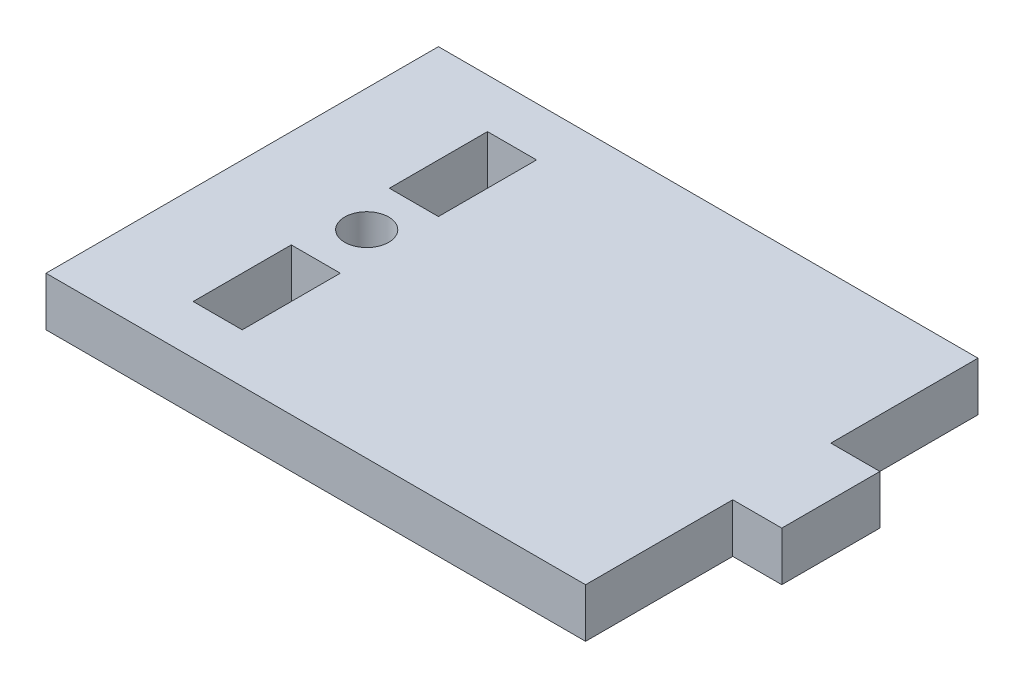
ISO-10303-21;
HEADER;
FILE_DESCRIPTION(('STEP AP214'),'2;1');
FILE_NAME('part.step','',(''),(''),'','','');
FILE_SCHEMA(('AUTOMOTIVE_DESIGN { 1 0 10303 214 1 1 1 1 }'));
ENDSEC;
DATA;
#1=APPLICATION_CONTEXT('core data for automotive mechanical design processes');
#2=APPLICATION_PROTOCOL_DEFINITION('international standard','automotive_design',2000,#1);
#3=PRODUCT_CONTEXT('',#1,'mechanical');
#4=PRODUCT('Part','Part','',(#3));
#5=PRODUCT_RELATED_PRODUCT_CATEGORY('part','',(#4));
#6=PRODUCT_DEFINITION_FORMATION('','',#4);
#7=PRODUCT_DEFINITION_CONTEXT('part definition',#1,'design');
#8=PRODUCT_DEFINITION('design','',#6,#7);
#9=PRODUCT_DEFINITION_SHAPE('','',#8);
#10=(LENGTH_UNIT() NAMED_UNIT(*) SI_UNIT(.MILLI.,.METRE.));
#11=(NAMED_UNIT(*) PLANE_ANGLE_UNIT() SI_UNIT($,.RADIAN.));
#12=(NAMED_UNIT(*) SI_UNIT($,.STERADIAN.) SOLID_ANGLE_UNIT());
#13=UNCERTAINTY_MEASURE_WITH_UNIT(LENGTH_MEASURE(1.E-05),#10,'distance_accuracy_value','');
#14=(GEOMETRIC_REPRESENTATION_CONTEXT(3) GLOBAL_UNCERTAINTY_ASSIGNED_CONTEXT((#13)) GLOBAL_UNIT_ASSIGNED_CONTEXT((#10,
#11,#12)) REPRESENTATION_CONTEXT('',''));
#15=CARTESIAN_POINT('',(0.,0.,0.));
#16=DIRECTION('',(0.,0.,1.));
#17=DIRECTION('',(1.,0.,0.));
#18=AXIS2_PLACEMENT_3D('',#15,#16,#17);
#19=CARTESIAN_POINT('',(0.,6.35,0.));
#20=DIRECTION('',(0.,-1.,0.));
#21=DIRECTION('',(0.,0.,-1.));
#22=AXIS2_PLACEMENT_3D('',#19,#20,#21);
#23=PLANE('',#22);
#24=DIRECTION('',(0.,0.,1.));
#25=VECTOR('',#24,1.);
#26=CARTESIAN_POINT('',(12.7,6.35,-44.45));
#27=LINE('',#26,#25);
#28=CARTESIAN_POINT('',(12.7,6.35,-44.45));
#29=VERTEX_POINT('',#28);
#30=CARTESIAN_POINT('',(12.7,6.35,-31.75));
#31=VERTEX_POINT('',#30);
#32=EDGE_CURVE('E185',#29,#31,#27,.T.);
#33=ORIENTED_EDGE('',*,*,#32,.F.);
#34=DIRECTION('',(-1.,0.,0.));
#35=VECTOR('',#34,1.);
#36=CARTESIAN_POINT('',(12.7,6.35,-44.45));
#37=LINE('',#36,#35);
#38=CARTESIAN_POINT('',(19.05,6.35,-44.45));
#39=VERTEX_POINT('',#38);
#40=EDGE_CURVE('E193',#39,#29,#37,.T.);
#41=ORIENTED_EDGE('',*,*,#40,.F.);
#42=DIRECTION('',(0.,0.,-1.));
#43=VECTOR('',#42,1.);
#44=CARTESIAN_POINT('',(19.05,6.35,-44.45));
#45=LINE('',#44,#43);
#46=CARTESIAN_POINT('',(19.05,6.35,-31.75));
#47=VERTEX_POINT('',#46);
#48=EDGE_CURVE('E190',#47,#39,#45,.T.);
#49=ORIENTED_EDGE('',*,*,#48,.F.);
#50=DIRECTION('',(1.,0.,0.));
#51=VECTOR('',#50,1.);
#52=CARTESIAN_POINT('',(12.7,6.35,-31.75));
#53=LINE('',#52,#51);
#54=EDGE_CURVE('E187',#31,#47,#53,.T.);
#55=ORIENTED_EDGE('',*,*,#54,.F.);
#56=EDGE_LOOP('',(#33,#41,#49,#55));
#57=FACE_BOUND('',#56,.T.);
#58=DIRECTION('',(0.,0.,1.));
#59=VECTOR('',#58,1.);
#60=CARTESIAN_POINT('',(0.,6.35,0.));
#61=LINE('',#60,#59);
#62=CARTESIAN_POINT('',(0.,6.35,-50.8));
#63=VERTEX_POINT('',#62);
#64=CARTESIAN_POINT('',(0.,6.35,0.));
#65=VERTEX_POINT('',#64);
#66=EDGE_CURVE('E216',#63,#65,#61,.T.);
#67=ORIENTED_EDGE('',*,*,#66,.T.);
#68=DIRECTION('',(1.,0.,0.));
#69=VECTOR('',#68,1.);
#70=CARTESIAN_POINT('',(0.,6.35,0.));
#71=LINE('',#70,#69);
#72=CARTESIAN_POINT('',(69.85,6.35,0.));
#73=VERTEX_POINT('',#72);
#74=EDGE_CURVE('E219',#65,#73,#71,.T.);
#75=ORIENTED_EDGE('',*,*,#74,.T.);
#76=DIRECTION('',(0.,0.,-1.));
#77=VECTOR('',#76,1.);
#78=CARTESIAN_POINT('',(69.85,6.35,-19.05));
#79=LINE('',#78,#77);
#80=CARTESIAN_POINT('',(69.85,6.35,-19.05));
#81=VERTEX_POINT('',#80);
#82=EDGE_CURVE('E222',#73,#81,#79,.T.);
#83=ORIENTED_EDGE('',*,*,#82,.T.);
#84=DIRECTION('',(1.,0.,0.));
#85=VECTOR('',#84,1.);
#86=CARTESIAN_POINT('',(76.2,6.35,-19.05));
#87=LINE('',#86,#85);
#88=CARTESIAN_POINT('',(76.2,6.35,-19.05));
#89=VERTEX_POINT('',#88);
#90=EDGE_CURVE('E224',#81,#89,#87,.T.);
#91=ORIENTED_EDGE('',*,*,#90,.T.);
#92=DIRECTION('',(0.,0.,-1.));
#93=VECTOR('',#92,1.);
#94=CARTESIAN_POINT('',(76.2,6.35,-19.05));
#95=LINE('',#94,#93);
#96=CARTESIAN_POINT('',(76.2,6.35,-31.75));
#97=VERTEX_POINT('',#96);
#98=EDGE_CURVE('E226',#89,#97,#95,.T.);
#99=ORIENTED_EDGE('',*,*,#98,.T.);
#100=DIRECTION('',(-1.,0.,0.));
#101=VECTOR('',#100,1.);
#102=CARTESIAN_POINT('',(76.2,6.35,-31.75));
#103=LINE('',#102,#101);
#104=CARTESIAN_POINT('',(69.85,6.35,-31.75));
#105=VERTEX_POINT('',#104);
#106=EDGE_CURVE('E228',#97,#105,#103,.T.);
#107=ORIENTED_EDGE('',*,*,#106,.T.);
#108=DIRECTION('',(0.,0.,-1.));
#109=VECTOR('',#108,1.);
#110=CARTESIAN_POINT('',(69.85,6.35,-31.75));
#111=LINE('',#110,#109);
#112=CARTESIAN_POINT('',(69.85,6.35,-50.8));
#113=VERTEX_POINT('',#112);
#114=EDGE_CURVE('E230',#105,#113,#111,.T.);
#115=ORIENTED_EDGE('',*,*,#114,.T.);
#116=DIRECTION('',(-1.,0.,0.));
#117=VECTOR('',#116,1.);
#118=CARTESIAN_POINT('',(0.,6.35,-50.8));
#119=LINE('',#118,#117);
#120=EDGE_CURVE('E232',#113,#63,#119,.T.);
#121=ORIENTED_EDGE('',*,*,#120,.T.);
#122=EDGE_LOOP('',(#67,#75,#83,#91,#99,#107,#115,#121));
#123=FACE_BOUND('',#122,.T.);
#124=DIRECTION('',(0.,0.,1.));
#125=VECTOR('',#124,1.);
#126=CARTESIAN_POINT('',(12.7,6.35,-19.05));
#127=LINE('',#126,#125);
#128=CARTESIAN_POINT('',(12.7,6.35,-19.05));
#129=VERTEX_POINT('',#128);
#130=CARTESIAN_POINT('',(12.7,6.35,-6.35));
#131=VERTEX_POINT('',#130);
#132=EDGE_CURVE('E146',#129,#131,#127,.T.);
#133=ORIENTED_EDGE('',*,*,#132,.F.);
#134=DIRECTION('',(-1.,0.,0.));
#135=VECTOR('',#134,1.);
#136=CARTESIAN_POINT('',(12.7,6.35,-19.05));
#137=LINE('',#136,#135);
#138=CARTESIAN_POINT('',(19.05,6.35,-19.05));
#139=VERTEX_POINT('',#138);
#140=EDGE_CURVE('E169',#139,#129,#137,.T.);
#141=ORIENTED_EDGE('',*,*,#140,.F.);
#142=DIRECTION('',(0.,0.,-1.));
#143=VECTOR('',#142,1.);
#144=CARTESIAN_POINT('',(19.05,6.35,-19.05));
#145=LINE('',#144,#143);
#146=CARTESIAN_POINT('',(19.05,6.35,-6.35));
#147=VERTEX_POINT('',#146);
#148=EDGE_CURVE('E167',#147,#139,#145,.T.);
#149=ORIENTED_EDGE('',*,*,#148,.F.);
#150=DIRECTION('',(1.,0.,0.));
#151=VECTOR('',#150,1.);
#152=CARTESIAN_POINT('',(12.7,6.35,-6.35));
#153=LINE('',#152,#151);
#154=EDGE_CURVE('E154',#131,#147,#153,.T.);
#155=ORIENTED_EDGE('',*,*,#154,.F.);
#156=EDGE_LOOP('',(#133,#141,#149,#155));
#157=FACE_BOUND('',#156,.T.);
#158=CARTESIAN_POINT('',(15.875,6.35,-25.6404290046936));
#159=DIRECTION('',(0.,1.,0.));
#160=DIRECTION('',(0.,0.,1.));
#161=AXIS2_PLACEMENT_3D('',#158,#159,#160);
#162=CIRCLE('',#161,2.84664653294887);
#163=CARTESIAN_POINT('',(15.875,6.35,-22.7937824717447));
#164=VERTEX_POINT('',#163);
#165=EDGE_CURVE('E175',#164,#164,#162,.T.);
#166=ORIENTED_EDGE('',*,*,#165,.F.);
#167=EDGE_LOOP('',(#166));
#168=FACE_BOUND('',#167,.T.);
#169=ADVANCED_FACE('F33',(#57,#123,#157,#168),#23,.F.);
#170=CARTESIAN_POINT('',(0.,0.,0.));
#171=DIRECTION('',(0.,-1.,0.));
#172=DIRECTION('',(0.,0.,-1.));
#173=AXIS2_PLACEMENT_3D('',#170,#171,#172);
#174=PLANE('',#173);
#175=DIRECTION('',(-1.,0.,0.));
#176=VECTOR('',#175,1.);
#177=CARTESIAN_POINT('',(12.7,0.,-19.05));
#178=LINE('',#177,#176);
#179=CARTESIAN_POINT('',(19.05,0.,-19.05));
#180=VERTEX_POINT('',#179);
#181=CARTESIAN_POINT('',(12.7,0.,-19.05));
#182=VERTEX_POINT('',#181);
#183=EDGE_CURVE('E155',#180,#182,#178,.T.);
#184=ORIENTED_EDGE('',*,*,#183,.T.);
#185=DIRECTION('',(0.,0.,1.));
#186=VECTOR('',#185,1.);
#187=CARTESIAN_POINT('',(12.7,0.,-19.05));
#188=LINE('',#187,#186);
#189=CARTESIAN_POINT('',(12.7,0.,-6.35));
#190=VERTEX_POINT('',#189);
#191=EDGE_CURVE('E56',#182,#190,#188,.T.);
#192=ORIENTED_EDGE('',*,*,#191,.T.);
#193=DIRECTION('',(1.,0.,0.));
#194=VECTOR('',#193,1.);
#195=CARTESIAN_POINT('',(12.7,0.,-6.35));
#196=LINE('',#195,#194);
#197=CARTESIAN_POINT('',(19.05,0.,-6.35));
#198=VERTEX_POINT('',#197);
#199=EDGE_CURVE('E161',#190,#198,#196,.T.);
#200=ORIENTED_EDGE('',*,*,#199,.T.);
#201=DIRECTION('',(0.,0.,-1.));
#202=VECTOR('',#201,1.);
#203=CARTESIAN_POINT('',(19.05,0.,-19.05));
#204=LINE('',#203,#202);
#205=EDGE_CURVE('E177',#198,#180,#204,.T.);
#206=ORIENTED_EDGE('',*,*,#205,.T.);
#207=EDGE_LOOP('',(#184,#192,#200,#206));
#208=FACE_BOUND('',#207,.T.);
#209=DIRECTION('',(-1.,0.,0.));
#210=VECTOR('',#209,1.);
#211=CARTESIAN_POINT('',(12.7,0.,-44.45));
#212=LINE('',#211,#210);
#213=CARTESIAN_POINT('',(19.05,0.,-44.45));
#214=VERTEX_POINT('',#213);
#215=CARTESIAN_POINT('',(12.7,0.,-44.45));
#216=VERTEX_POINT('',#215);
#217=EDGE_CURVE('E188',#214,#216,#212,.T.);
#218=ORIENTED_EDGE('',*,*,#217,.T.);
#219=DIRECTION('',(0.,0.,1.));
#220=VECTOR('',#219,1.);
#221=CARTESIAN_POINT('',(12.7,0.,-44.45));
#222=LINE('',#221,#220);
#223=CARTESIAN_POINT('',(12.7,0.,-31.75));
#224=VERTEX_POINT('',#223);
#225=EDGE_CURVE('E162',#216,#224,#222,.T.);
#226=ORIENTED_EDGE('',*,*,#225,.T.);
#227=DIRECTION('',(1.,0.,0.));
#228=VECTOR('',#227,1.);
#229=CARTESIAN_POINT('',(12.7,0.,-31.75));
#230=LINE('',#229,#228);
#231=CARTESIAN_POINT('',(19.05,0.,-31.75));
#232=VERTEX_POINT('',#231);
#233=EDGE_CURVE('E198',#224,#232,#230,.T.);
#234=ORIENTED_EDGE('',*,*,#233,.T.);
#235=DIRECTION('',(0.,0.,-1.));
#236=VECTOR('',#235,1.);
#237=CARTESIAN_POINT('',(19.05,0.,-44.45));
#238=LINE('',#237,#236);
#239=EDGE_CURVE('E201',#232,#214,#238,.T.);
#240=ORIENTED_EDGE('',*,*,#239,.T.);
#241=EDGE_LOOP('',(#218,#226,#234,#240));
#242=FACE_BOUND('',#241,.T.);
#243=DIRECTION('',(0.,0.,1.));
#244=VECTOR('',#243,1.);
#245=CARTESIAN_POINT('',(0.,0.,0.));
#246=LINE('',#245,#244);
#247=CARTESIAN_POINT('',(0.,0.,-50.8));
#248=VERTEX_POINT('',#247);
#249=CARTESIAN_POINT('',(0.,0.,0.));
#250=VERTEX_POINT('',#249);
#251=EDGE_CURVE('E215',#248,#250,#246,.T.);
#252=ORIENTED_EDGE('',*,*,#251,.F.);
#253=DIRECTION('',(-1.,0.,0.));
#254=VECTOR('',#253,1.);
#255=CARTESIAN_POINT('',(0.,0.,-50.8));
#256=LINE('',#255,#254);
#257=CARTESIAN_POINT('',(69.85,0.,-50.8));
#258=VERTEX_POINT('',#257);
#259=EDGE_CURVE('E220',#258,#248,#256,.T.);
#260=ORIENTED_EDGE('',*,*,#259,.F.);
#261=DIRECTION('',(0.,0.,-1.));
#262=VECTOR('',#261,1.);
#263=CARTESIAN_POINT('',(69.85,0.,-31.75));
#264=LINE('',#263,#262);
#265=CARTESIAN_POINT('',(69.85,0.,-31.75));
#266=VERTEX_POINT('',#265);
#267=EDGE_CURVE('E247',#266,#258,#264,.T.);
#268=ORIENTED_EDGE('',*,*,#267,.F.);
#269=DIRECTION('',(-1.,0.,0.));
#270=VECTOR('',#269,1.);
#271=CARTESIAN_POINT('',(76.2,0.,-31.75));
#272=LINE('',#271,#270);
#273=CARTESIAN_POINT('',(76.2,0.,-31.75));
#274=VERTEX_POINT('',#273);
#275=EDGE_CURVE('E245',#274,#266,#272,.T.);
#276=ORIENTED_EDGE('',*,*,#275,.F.);
#277=DIRECTION('',(0.,0.,-1.));
#278=VECTOR('',#277,1.);
#279=CARTESIAN_POINT('',(76.2,0.,-19.05));
#280=LINE('',#279,#278);
#281=CARTESIAN_POINT('',(76.2,0.,-19.05));
#282=VERTEX_POINT('',#281);
#283=EDGE_CURVE('E243',#282,#274,#280,.T.);
#284=ORIENTED_EDGE('',*,*,#283,.F.);
#285=DIRECTION('',(1.,0.,0.));
#286=VECTOR('',#285,1.);
#287=CARTESIAN_POINT('',(76.2,0.,-19.05));
#288=LINE('',#287,#286);
#289=CARTESIAN_POINT('',(69.85,0.,-19.05));
#290=VERTEX_POINT('',#289);
#291=EDGE_CURVE('E241',#290,#282,#288,.T.);
#292=ORIENTED_EDGE('',*,*,#291,.F.);
#293=DIRECTION('',(0.,0.,-1.));
#294=VECTOR('',#293,1.);
#295=CARTESIAN_POINT('',(69.85,0.,-19.05));
#296=LINE('',#295,#294);
#297=CARTESIAN_POINT('',(69.85,0.,0.));
#298=VERTEX_POINT('',#297);
#299=EDGE_CURVE('E239',#298,#290,#296,.T.);
#300=ORIENTED_EDGE('',*,*,#299,.F.);
#301=DIRECTION('',(1.,0.,0.));
#302=VECTOR('',#301,1.);
#303=CARTESIAN_POINT('',(0.,0.,0.));
#304=LINE('',#303,#302);
#305=EDGE_CURVE('E237',#250,#298,#304,.T.);
#306=ORIENTED_EDGE('',*,*,#305,.F.);
#307=EDGE_LOOP('',(#252,#260,#268,#276,#284,#292,#300,#306));
#308=FACE_BOUND('',#307,.T.);
#309=CARTESIAN_POINT('',(15.875,0.,-25.6404290046936));
#310=DIRECTION('',(0.,1.,0.));
#311=DIRECTION('',(0.,0.,1.));
#312=AXIS2_PLACEMENT_3D('',#309,#310,#311);
#313=CIRCLE('',#312,2.84664653294887);
#314=CARTESIAN_POINT('',(15.875,0.,-22.7937824717447));
#315=VERTEX_POINT('',#314);
#316=EDGE_CURVE('E380',#315,#315,#313,.T.);
#317=ORIENTED_EDGE('',*,*,#316,.T.);
#318=EDGE_LOOP('',(#317));
#319=FACE_BOUND('',#318,.T.);
#320=ADVANCED_FACE('F277',(#208,#242,#308,#319),#174,.T.);
#321=CARTESIAN_POINT('',(0.,6.35,0.));
#322=DIRECTION('',(1.,0.,0.));
#323=DIRECTION('',(0.,0.,-1.));
#324=AXIS2_PLACEMENT_3D('',#321,#322,#323);
#325=PLANE('',#324);
#326=ORIENTED_EDGE('',*,*,#251,.T.);
#327=DIRECTION('',(0.,-1.,0.));
#328=VECTOR('',#327,1.);
#329=CARTESIAN_POINT('',(0.,6.35,0.));
#330=LINE('',#329,#328);
#331=EDGE_CURVE('E11',#65,#250,#330,.T.);
#332=ORIENTED_EDGE('',*,*,#331,.F.);
#333=ORIENTED_EDGE('',*,*,#66,.F.);
#334=DIRECTION('',(0.,-1.,0.));
#335=VECTOR('',#334,1.);
#336=CARTESIAN_POINT('',(0.,6.35,-50.8));
#337=LINE('',#336,#335);
#338=EDGE_CURVE('E234',#63,#248,#337,.T.);
#339=ORIENTED_EDGE('',*,*,#338,.T.);
#340=EDGE_LOOP('',(#326,#332,#333,#339));
#341=FACE_BOUND('',#340,.T.);
#342=ADVANCED_FACE('F35',(#341),#325,.F.);
#343=CARTESIAN_POINT('',(0.,6.35,0.));
#344=DIRECTION('',(0.,0.,-1.));
#345=DIRECTION('',(-1.,0.,0.));
#346=AXIS2_PLACEMENT_3D('',#343,#344,#345);
#347=PLANE('',#346);
#348=ORIENTED_EDGE('',*,*,#305,.T.);
#349=DIRECTION('',(0.,-1.,0.));
#350=VECTOR('',#349,1.);
#351=CARTESIAN_POINT('',(69.85,6.35,0.));
#352=LINE('',#351,#350);
#353=EDGE_CURVE('E41',#73,#298,#352,.T.);
#354=ORIENTED_EDGE('',*,*,#353,.F.);
#355=ORIENTED_EDGE('',*,*,#74,.F.);
#356=ORIENTED_EDGE('',*,*,#331,.T.);
#357=EDGE_LOOP('',(#348,#354,#355,#356));
#358=FACE_BOUND('',#357,.T.);
#359=ADVANCED_FACE('F294',(#358),#347,.F.);
#360=CARTESIAN_POINT('',(69.85,6.35,-19.05));
#361=DIRECTION('',(-1.,0.,0.));
#362=DIRECTION('',(0.,0.,1.));
#363=AXIS2_PLACEMENT_3D('',#360,#361,#362);
#364=PLANE('',#363);
#365=ORIENTED_EDGE('',*,*,#299,.T.);
#366=DIRECTION('',(0.,-1.,0.));
#367=VECTOR('',#366,1.);
#368=CARTESIAN_POINT('',(69.85,6.35,-19.05));
#369=LINE('',#368,#367);
#370=EDGE_CURVE('E264',#81,#290,#369,.T.);
#371=ORIENTED_EDGE('',*,*,#370,.F.);
#372=ORIENTED_EDGE('',*,*,#82,.F.);
#373=ORIENTED_EDGE('',*,*,#353,.T.);
#374=EDGE_LOOP('',(#365,#371,#372,#373));
#375=FACE_BOUND('',#374,.T.);
#376=ADVANCED_FACE('F271',(#375),#364,.F.);
#377=CARTESIAN_POINT('',(76.2,6.35,-19.05));
#378=DIRECTION('',(0.,0.,-1.));
#379=DIRECTION('',(-1.,0.,0.));
#380=AXIS2_PLACEMENT_3D('',#377,#378,#379);
#381=PLANE('',#380);
#382=ORIENTED_EDGE('',*,*,#291,.T.);
#383=DIRECTION('',(0.,-1.,0.));
#384=VECTOR('',#383,1.);
#385=CARTESIAN_POINT('',(76.2,6.35,-19.05));
#386=LINE('',#385,#384);
#387=EDGE_CURVE('E261',#89,#282,#386,.T.);
#388=ORIENTED_EDGE('',*,*,#387,.F.);
#389=ORIENTED_EDGE('',*,*,#90,.F.);
#390=ORIENTED_EDGE('',*,*,#370,.T.);
#391=EDGE_LOOP('',(#382,#388,#389,#390));
#392=FACE_BOUND('',#391,.T.);
#393=ADVANCED_FACE('F283',(#392),#381,.F.);
#394=CARTESIAN_POINT('',(76.2,6.35,-19.05));
#395=DIRECTION('',(-1.,0.,0.));
#396=DIRECTION('',(0.,0.,1.));
#397=AXIS2_PLACEMENT_3D('',#394,#395,#396);
#398=PLANE('',#397);
#399=ORIENTED_EDGE('',*,*,#283,.T.);
#400=DIRECTION('',(0.,-1.,0.));
#401=VECTOR('',#400,1.);
#402=CARTESIAN_POINT('',(76.2,6.35,-31.75));
#403=LINE('',#402,#401);
#404=EDGE_CURVE('E258',#97,#274,#403,.T.);
#405=ORIENTED_EDGE('',*,*,#404,.F.);
#406=ORIENTED_EDGE('',*,*,#98,.F.);
#407=ORIENTED_EDGE('',*,*,#387,.T.);
#408=EDGE_LOOP('',(#399,#405,#406,#407));
#409=FACE_BOUND('',#408,.T.);
#410=ADVANCED_FACE('F287',(#409),#398,.F.);
#411=CARTESIAN_POINT('',(76.2,6.35,-31.75));
#412=DIRECTION('',(0.,0.,1.));
#413=DIRECTION('',(1.,0.,0.));
#414=AXIS2_PLACEMENT_3D('',#411,#412,#413);
#415=PLANE('',#414);
#416=ORIENTED_EDGE('',*,*,#275,.T.);
#417=DIRECTION('',(0.,-1.,0.));
#418=VECTOR('',#417,1.);
#419=CARTESIAN_POINT('',(69.85,6.35,-31.75));
#420=LINE('',#419,#418);
#421=EDGE_CURVE('E255',#105,#266,#420,.T.);
#422=ORIENTED_EDGE('',*,*,#421,.F.);
#423=ORIENTED_EDGE('',*,*,#106,.F.);
#424=ORIENTED_EDGE('',*,*,#404,.T.);
#425=EDGE_LOOP('',(#416,#422,#423,#424));
#426=FACE_BOUND('',#425,.T.);
#427=ADVANCED_FACE('F307',(#426),#415,.F.);
#428=CARTESIAN_POINT('',(69.85,6.35,-31.75));
#429=DIRECTION('',(-1.,0.,0.));
#430=DIRECTION('',(0.,0.,1.));
#431=AXIS2_PLACEMENT_3D('',#428,#429,#430);
#432=PLANE('',#431);
#433=ORIENTED_EDGE('',*,*,#267,.T.);
#434=DIRECTION('',(0.,-1.,0.));
#435=VECTOR('',#434,1.);
#436=CARTESIAN_POINT('',(69.85,6.35,-50.8));
#437=LINE('',#436,#435);
#438=EDGE_CURVE('E252',#113,#258,#437,.T.);
#439=ORIENTED_EDGE('',*,*,#438,.F.);
#440=ORIENTED_EDGE('',*,*,#114,.F.);
#441=ORIENTED_EDGE('',*,*,#421,.T.);
#442=EDGE_LOOP('',(#433,#439,#440,#441));
#443=FACE_BOUND('',#442,.T.);
#444=ADVANCED_FACE('F305',(#443),#432,.F.);
#445=CARTESIAN_POINT('',(0.,6.35,-50.8));
#446=DIRECTION('',(0.,0.,1.));
#447=DIRECTION('',(1.,0.,0.));
#448=AXIS2_PLACEMENT_3D('',#445,#446,#447);
#449=PLANE('',#448);
#450=ORIENTED_EDGE('',*,*,#259,.T.);
#451=ORIENTED_EDGE('',*,*,#338,.F.);
#452=ORIENTED_EDGE('',*,*,#120,.F.);
#453=ORIENTED_EDGE('',*,*,#438,.T.);
#454=EDGE_LOOP('',(#450,#451,#452,#453));
#455=FACE_BOUND('',#454,.T.);
#456=ADVANCED_FACE('F300',(#455),#449,.F.);
#457=CARTESIAN_POINT('',(12.7,6.35,-44.45));
#458=DIRECTION('',(1.,0.,0.));
#459=DIRECTION('',(0.,0.,-1.));
#460=AXIS2_PLACEMENT_3D('',#457,#458,#459);
#461=PLANE('',#460);
#462=ORIENTED_EDGE('',*,*,#225,.F.);
#463=DIRECTION('',(0.,-1.,0.));
#464=VECTOR('',#463,1.);
#465=CARTESIAN_POINT('',(12.7,6.35,-44.45));
#466=LINE('',#465,#464);
#467=EDGE_CURVE('E195',#29,#216,#466,.T.);
#468=ORIENTED_EDGE('',*,*,#467,.F.);
#469=ORIENTED_EDGE('',*,*,#32,.T.);
#470=DIRECTION('',(0.,-1.,0.));
#471=VECTOR('',#470,1.);
#472=CARTESIAN_POINT('',(12.7,6.35,-31.75));
#473=LINE('',#472,#471);
#474=EDGE_CURVE('E212',#31,#224,#473,.T.);
#475=ORIENTED_EDGE('',*,*,#474,.T.);
#476=EDGE_LOOP('',(#462,#468,#469,#475));
#477=FACE_BOUND('',#476,.T.);
#478=ADVANCED_FACE('F326',(#477),#461,.T.);
#479=CARTESIAN_POINT('',(12.7,6.35,-31.75));
#480=DIRECTION('',(0.,0.,-1.));
#481=DIRECTION('',(-1.,0.,0.));
#482=AXIS2_PLACEMENT_3D('',#479,#480,#481);
#483=PLANE('',#482);
#484=ORIENTED_EDGE('',*,*,#233,.F.);
#485=ORIENTED_EDGE('',*,*,#474,.F.);
#486=ORIENTED_EDGE('',*,*,#54,.T.);
#487=DIRECTION('',(0.,-1.,0.));
#488=VECTOR('',#487,1.);
#489=CARTESIAN_POINT('',(19.05,6.35,-31.75));
#490=LINE('',#489,#488);
#491=EDGE_CURVE('E210',#47,#232,#490,.T.);
#492=ORIENTED_EDGE('',*,*,#491,.T.);
#493=EDGE_LOOP('',(#484,#485,#486,#492));
#494=FACE_BOUND('',#493,.T.);
#495=ADVANCED_FACE('F333',(#494),#483,.T.);
#496=CARTESIAN_POINT('',(19.05,6.35,-44.45));
#497=DIRECTION('',(-1.,0.,0.));
#498=DIRECTION('',(0.,0.,1.));
#499=AXIS2_PLACEMENT_3D('',#496,#497,#498);
#500=PLANE('',#499);
#501=ORIENTED_EDGE('',*,*,#239,.F.);
#502=ORIENTED_EDGE('',*,*,#491,.F.);
#503=ORIENTED_EDGE('',*,*,#48,.T.);
#504=DIRECTION('',(0.,-1.,0.));
#505=VECTOR('',#504,1.);
#506=CARTESIAN_POINT('',(19.05,6.35,-44.45));
#507=LINE('',#506,#505);
#508=EDGE_CURVE('E208',#39,#214,#507,.T.);
#509=ORIENTED_EDGE('',*,*,#508,.T.);
#510=EDGE_LOOP('',(#501,#502,#503,#509));
#511=FACE_BOUND('',#510,.T.);
#512=ADVANCED_FACE('F338',(#511),#500,.T.);
#513=CARTESIAN_POINT('',(12.7,6.35,-44.45));
#514=DIRECTION('',(0.,0.,1.));
#515=DIRECTION('',(1.,0.,0.));
#516=AXIS2_PLACEMENT_3D('',#513,#514,#515);
#517=PLANE('',#516);
#518=ORIENTED_EDGE('',*,*,#217,.F.);
#519=ORIENTED_EDGE('',*,*,#508,.F.);
#520=ORIENTED_EDGE('',*,*,#40,.T.);
#521=ORIENTED_EDGE('',*,*,#467,.T.);
#522=EDGE_LOOP('',(#518,#519,#520,#521));
#523=FACE_BOUND('',#522,.T.);
#524=ADVANCED_FACE('F345',(#523),#517,.T.);
#525=CARTESIAN_POINT('',(12.7,6.35,-19.05));
#526=DIRECTION('',(1.,0.,0.));
#527=DIRECTION('',(0.,0.,-1.));
#528=AXIS2_PLACEMENT_3D('',#525,#526,#527);
#529=PLANE('',#528);
#530=ORIENTED_EDGE('',*,*,#191,.F.);
#531=DIRECTION('',(0.,-1.,0.));
#532=VECTOR('',#531,1.);
#533=CARTESIAN_POINT('',(12.7,6.35,-19.05));
#534=LINE('',#533,#532);
#535=EDGE_CURVE('E150',#129,#182,#534,.T.);
#536=ORIENTED_EDGE('',*,*,#535,.F.);
#537=ORIENTED_EDGE('',*,*,#132,.T.);
#538=DIRECTION('',(0.,-1.,0.));
#539=VECTOR('',#538,1.);
#540=CARTESIAN_POINT('',(12.7,6.35,-6.35));
#541=LINE('',#540,#539);
#542=EDGE_CURVE('E149',#131,#190,#541,.T.);
#543=ORIENTED_EDGE('',*,*,#542,.T.);
#544=EDGE_LOOP('',(#530,#536,#537,#543));
#545=FACE_BOUND('',#544,.T.);
#546=ADVANCED_FACE('F148',(#545),#529,.T.);
#547=CARTESIAN_POINT('',(12.7,6.35,-6.35));
#548=DIRECTION('',(0.,0.,-1.));
#549=DIRECTION('',(-1.,0.,0.));
#550=AXIS2_PLACEMENT_3D('',#547,#548,#549);
#551=PLANE('',#550);
#552=ORIENTED_EDGE('',*,*,#199,.F.);
#553=ORIENTED_EDGE('',*,*,#542,.F.);
#554=ORIENTED_EDGE('',*,*,#154,.T.);
#555=DIRECTION('',(0.,-1.,0.));
#556=VECTOR('',#555,1.);
#557=CARTESIAN_POINT('',(19.05,6.35,-6.35));
#558=LINE('',#557,#556);
#559=EDGE_CURVE('E163',#147,#198,#558,.T.);
#560=ORIENTED_EDGE('',*,*,#559,.T.);
#561=EDGE_LOOP('',(#552,#553,#554,#560));
#562=FACE_BOUND('',#561,.T.);
#563=ADVANCED_FACE('F158',(#562),#551,.T.);
#564=CARTESIAN_POINT('',(19.05,6.35,-19.05));
#565=DIRECTION('',(-1.,0.,0.));
#566=DIRECTION('',(0.,0.,1.));
#567=AXIS2_PLACEMENT_3D('',#564,#565,#566);
#568=PLANE('',#567);
#569=ORIENTED_EDGE('',*,*,#205,.F.);
#570=ORIENTED_EDGE('',*,*,#559,.F.);
#571=ORIENTED_EDGE('',*,*,#148,.T.);
#572=DIRECTION('',(0.,-1.,0.));
#573=VECTOR('',#572,1.);
#574=CARTESIAN_POINT('',(19.05,6.35,-19.05));
#575=LINE('',#574,#573);
#576=EDGE_CURVE('E48',#139,#180,#575,.T.);
#577=ORIENTED_EDGE('',*,*,#576,.T.);
#578=EDGE_LOOP('',(#569,#570,#571,#577));
#579=FACE_BOUND('',#578,.T.);
#580=ADVANCED_FACE('F363',(#579),#568,.T.);
#581=CARTESIAN_POINT('',(12.7,6.35,-19.05));
#582=DIRECTION('',(0.,0.,1.));
#583=DIRECTION('',(1.,0.,0.));
#584=AXIS2_PLACEMENT_3D('',#581,#582,#583);
#585=PLANE('',#584);
#586=ORIENTED_EDGE('',*,*,#183,.F.);
#587=ORIENTED_EDGE('',*,*,#576,.F.);
#588=ORIENTED_EDGE('',*,*,#140,.T.);
#589=ORIENTED_EDGE('',*,*,#535,.T.);
#590=EDGE_LOOP('',(#586,#587,#588,#589));
#591=FACE_BOUND('',#590,.T.);
#592=ADVANCED_FACE('F366',(#591),#585,.T.);
#593=CARTESIAN_POINT('',(15.875,6.35,-25.6404290046936));
#594=DIRECTION('',(0.,-1.,0.));
#595=DIRECTION('',(0.,0.,-1.));
#596=AXIS2_PLACEMENT_3D('',#593,#594,#595);
#597=CYLINDRICAL_SURFACE('',#596,2.84664653294887);
#598=ORIENTED_EDGE('',*,*,#165,.T.);
#599=EDGE_LOOP('',(#598));
#600=FACE_BOUND('',#599,.T.);
#601=ORIENTED_EDGE('',*,*,#316,.F.);
#602=EDGE_LOOP('',(#601));
#603=FACE_BOUND('',#602,.T.);
#604=ADVANCED_FACE('F370',(#600,#603),#597,.F.);
#605=CLOSED_SHELL('',(#169,#320,#342,#359,#376,#393,#410,#427,#444,#456,#478,#495,#512,#524,
#546,#563,#580,#592,#604));
#606=MANIFOLD_SOLID_BREP('B2',#605);
#607=ADVANCED_BREP_SHAPE_REPRESENTATION('',(#18,#606),#14);
#608=SHAPE_DEFINITION_REPRESENTATION(#9,#607);
ENDSEC;
END-ISO-10303-21;
